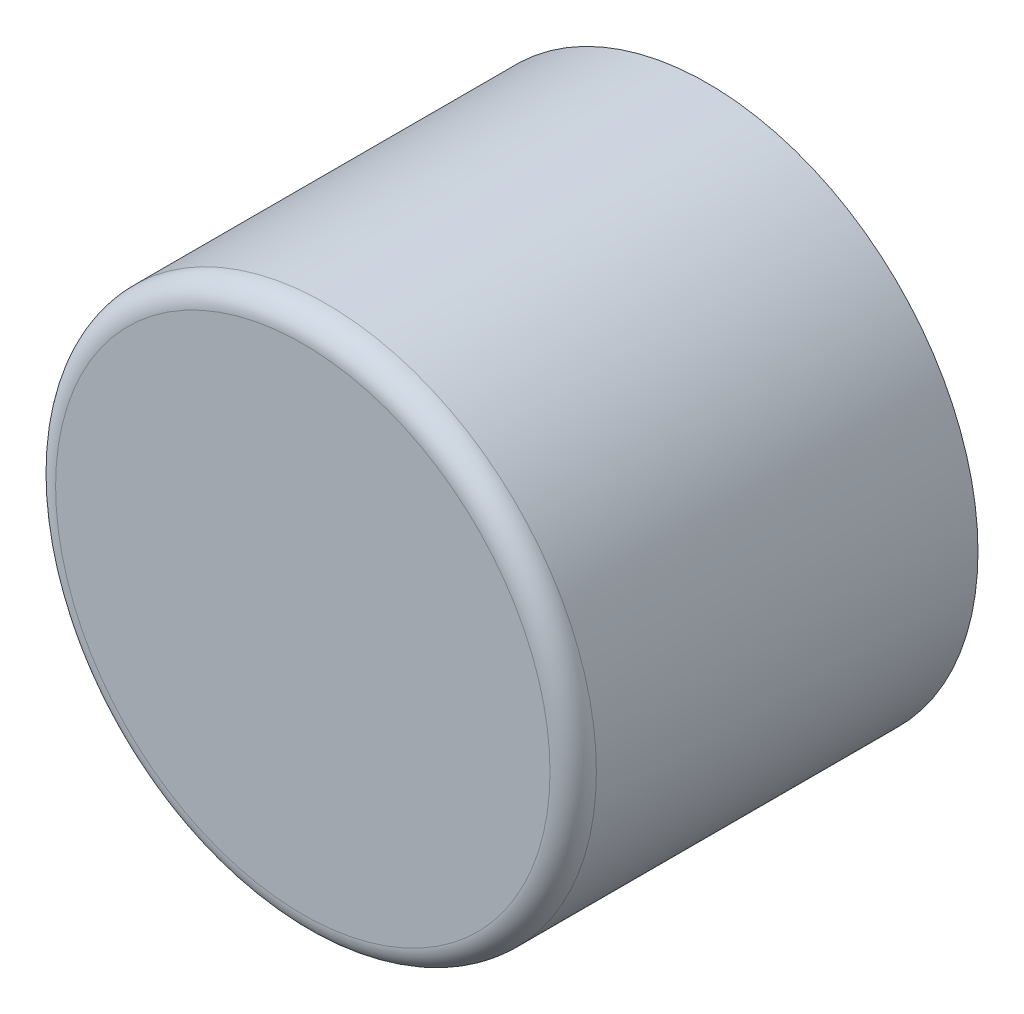
ISO-10303-21;
HEADER;
FILE_DESCRIPTION(('STEP AP214'),'2;1');
FILE_NAME('part.step','',(''),(''),'','','');
FILE_SCHEMA(('AUTOMOTIVE_DESIGN { 1 0 10303 214 1 1 1 1 }'));
ENDSEC;
DATA;
#1=APPLICATION_CONTEXT('core data for automotive mechanical design processes');
#2=APPLICATION_PROTOCOL_DEFINITION('international standard','automotive_design',2000,#1);
#3=PRODUCT_CONTEXT('',#1,'mechanical');
#4=PRODUCT('Part','Part','',(#3));
#5=PRODUCT_RELATED_PRODUCT_CATEGORY('part','',(#4));
#6=PRODUCT_DEFINITION_FORMATION('','',#4);
#7=PRODUCT_DEFINITION_CONTEXT('part definition',#1,'design');
#8=PRODUCT_DEFINITION('design','',#6,#7);
#9=PRODUCT_DEFINITION_SHAPE('','',#8);
#10=(LENGTH_UNIT() NAMED_UNIT(*) SI_UNIT(.MILLI.,.METRE.));
#11=(NAMED_UNIT(*) PLANE_ANGLE_UNIT() SI_UNIT($,.RADIAN.));
#12=(NAMED_UNIT(*) SI_UNIT($,.STERADIAN.) SOLID_ANGLE_UNIT());
#13=UNCERTAINTY_MEASURE_WITH_UNIT(LENGTH_MEASURE(1.E-05),#10,'distance_accuracy_value','');
#14=(GEOMETRIC_REPRESENTATION_CONTEXT(3) GLOBAL_UNCERTAINTY_ASSIGNED_CONTEXT((#13)) GLOBAL_UNIT_ASSIGNED_CONTEXT((#10,
#11,#12)) REPRESENTATION_CONTEXT('',''));
#15=CARTESIAN_POINT('',(0.,0.,0.));
#16=DIRECTION('',(0.,0.,1.));
#17=DIRECTION('',(1.,0.,0.));
#18=AXIS2_PLACEMENT_3D('',#15,#16,#17);
#19=CARTESIAN_POINT('',(0.,0.,28.85));
#20=DIRECTION('',(0.,0.,1.));
#21=DIRECTION('',(1.,0.,0.));
#22=AXIS2_PLACEMENT_3D('',#19,#20,#21);
#23=CYLINDRICAL_SURFACE('',#22,17.5);
#24=CARTESIAN_POINT('',(0.,0.,53.55));
#25=DIRECTION('',(0.,0.,1.));
#26=DIRECTION('',(1.,0.,0.));
#27=AXIS2_PLACEMENT_3D('',#24,#25,#26);
#28=CIRCLE('',#27,17.5);
#29=CARTESIAN_POINT('',(17.5,0.,53.55));
#30=VERTEX_POINT('',#29);
#31=EDGE_CURVE('E10',#30,#30,#28,.F.);
#32=ORIENTED_EDGE('',*,*,#31,.T.);
#33=EDGE_LOOP('',(#32));
#34=FACE_BOUND('',#33,.T.);
#35=CARTESIAN_POINT('',(0.,0.,28.85));
#36=DIRECTION('',(0.,0.,1.));
#37=DIRECTION('',(1.,0.,0.));
#38=AXIS2_PLACEMENT_3D('',#35,#36,#37);
#39=CIRCLE('',#38,17.5);
#40=CARTESIAN_POINT('',(17.5,0.,28.85));
#41=VERTEX_POINT('',#40);
#42=EDGE_CURVE('E31',#41,#41,#39,.T.);
#43=ORIENTED_EDGE('',*,*,#42,.T.);
#44=EDGE_LOOP('',(#43));
#45=FACE_BOUND('',#44,.T.);
#46=ADVANCED_FACE('F15',(#34,#45),#23,.T.);
#47=CARTESIAN_POINT('',(0.,0.,28.85));
#48=DIRECTION('',(0.,0.,1.));
#49=DIRECTION('',(1.,0.,0.));
#50=AXIS2_PLACEMENT_3D('',#47,#48,#49);
#51=PLANE('',#50);
#52=ORIENTED_EDGE('',*,*,#42,.F.);
#53=EDGE_LOOP('',(#52));
#54=FACE_BOUND('',#53,.T.);
#55=ADVANCED_FACE('F43',(#54),#51,.F.);
#56=CARTESIAN_POINT('',(0.,0.,55.05));
#57=DIRECTION('',(0.,0.,1.));
#58=DIRECTION('',(1.,0.,0.));
#59=AXIS2_PLACEMENT_3D('',#56,#57,#58);
#60=PLANE('',#59);
#61=CARTESIAN_POINT('',(0.,0.,55.05));
#62=DIRECTION('',(0.,0.,1.));
#63=DIRECTION('',(1.,0.,0.));
#64=AXIS2_PLACEMENT_3D('',#61,#62,#63);
#65=CIRCLE('',#64,16.);
#66=CARTESIAN_POINT('',(16.,0.,55.05));
#67=VERTEX_POINT('',#66);
#68=EDGE_CURVE('E23',#67,#67,#65,.T.);
#69=ORIENTED_EDGE('',*,*,#68,.T.);
#70=EDGE_LOOP('',(#69));
#71=FACE_BOUND('',#70,.T.);
#72=ADVANCED_FACE('F45',(#71),#60,.T.);
#73=CARTESIAN_POINT('',(0.,0.,53.55));
#74=DIRECTION('',(0.,0.,1.));
#75=DIRECTION('',(1.,0.,0.));
#76=AXIS2_PLACEMENT_3D('',#73,#74,#75);
#77=TOROIDAL_SURFACE('',#76,16.,1.5);
#78=ORIENTED_EDGE('',*,*,#31,.F.);
#79=EDGE_LOOP('',(#78));
#80=FACE_BOUND('',#79,.T.);
#81=ORIENTED_EDGE('',*,*,#68,.F.);
#82=EDGE_LOOP('',(#81));
#83=FACE_BOUND('',#82,.T.);
#84=ADVANCED_FACE('F17',(#80,#83),#77,.T.);
#85=CLOSED_SHELL('',(#46,#55,#72,#84));
#86=MANIFOLD_SOLID_BREP('B1',#85);
#87=ADVANCED_BREP_SHAPE_REPRESENTATION('',(#18,#86),#14);
#88=SHAPE_DEFINITION_REPRESENTATION(#9,#87);
ENDSEC;
END-ISO-10303-21;
